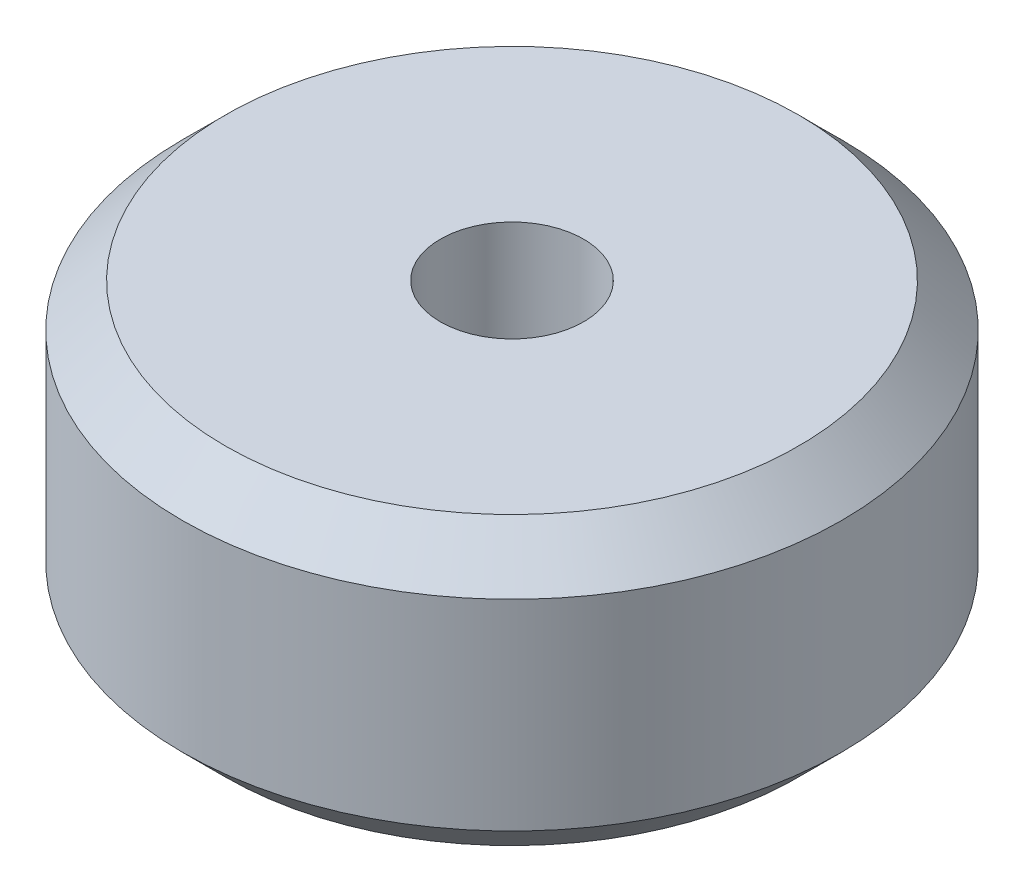
ISO-10303-21;
HEADER;
FILE_DESCRIPTION(('STEP AP214'),'2;1');
FILE_NAME('part.step','',(''),(''),'','','');
FILE_SCHEMA(('AUTOMOTIVE_DESIGN { 1 0 10303 214 1 1 1 1 }'));
ENDSEC;
DATA;
#1=APPLICATION_CONTEXT('core data for automotive mechanical design processes');
#2=APPLICATION_PROTOCOL_DEFINITION('international standard','automotive_design',2000,#1);
#3=PRODUCT_CONTEXT('',#1,'mechanical');
#4=PRODUCT('Part','Part','',(#3));
#5=PRODUCT_RELATED_PRODUCT_CATEGORY('part','',(#4));
#6=PRODUCT_DEFINITION_FORMATION('','',#4);
#7=PRODUCT_DEFINITION_CONTEXT('part definition',#1,'design');
#8=PRODUCT_DEFINITION('design','',#6,#7);
#9=PRODUCT_DEFINITION_SHAPE('','',#8);
#10=(LENGTH_UNIT() NAMED_UNIT(*) SI_UNIT(.MILLI.,.METRE.));
#11=(NAMED_UNIT(*) PLANE_ANGLE_UNIT() SI_UNIT($,.RADIAN.));
#12=(NAMED_UNIT(*) SI_UNIT($,.STERADIAN.) SOLID_ANGLE_UNIT());
#13=UNCERTAINTY_MEASURE_WITH_UNIT(LENGTH_MEASURE(1.E-05),#10,'distance_accuracy_value','');
#14=(GEOMETRIC_REPRESENTATION_CONTEXT(3) GLOBAL_UNCERTAINTY_ASSIGNED_CONTEXT((#13)) GLOBAL_UNIT_ASSIGNED_CONTEXT((#10,
#11,#12)) REPRESENTATION_CONTEXT('',''));
#15=CARTESIAN_POINT('',(0.,0.,0.));
#16=DIRECTION('',(0.,0.,1.));
#17=DIRECTION('',(1.,0.,0.));
#18=AXIS2_PLACEMENT_3D('',#15,#16,#17);
#19=CARTESIAN_POINT('',(0.,50.,0.));
#20=DIRECTION('',(0.,1.,0.));
#21=DIRECTION('',(0.,0.,1.));
#22=AXIS2_PLACEMENT_3D('',#19,#20,#21);
#23=CYLINDRICAL_SURFACE('',#22,2.5);
#24=CARTESIAN_POINT('',(0.,-5.,0.));
#25=DIRECTION('',(0.,1.,0.));
#26=DIRECTION('',(0.,0.,1.));
#27=AXIS2_PLACEMENT_3D('',#24,#25,#26);
#28=CIRCLE('',#27,2.5);
#29=CARTESIAN_POINT('',(0.,-5.,2.5));
#30=VERTEX_POINT('',#29);
#31=EDGE_CURVE('E55',#30,#30,#28,.T.);
#32=ORIENTED_EDGE('',*,*,#31,.F.);
#33=EDGE_LOOP('',(#32));
#34=FACE_BOUND('',#33,.T.);
#35=CARTESIAN_POINT('',(0.,5.,0.));
#36=DIRECTION('',(0.,1.,0.));
#37=DIRECTION('',(0.,0.,1.));
#38=AXIS2_PLACEMENT_3D('',#35,#36,#37);
#39=CIRCLE('',#38,2.5);
#40=CARTESIAN_POINT('',(0.,5.,2.5));
#41=VERTEX_POINT('',#40);
#42=EDGE_CURVE('E10',#41,#41,#39,.T.);
#43=ORIENTED_EDGE('',*,*,#42,.T.);
#44=EDGE_LOOP('',(#43));
#45=FACE_BOUND('',#44,.T.);
#46=ADVANCED_FACE('F33',(#34,#45),#23,.F.);
#47=CARTESIAN_POINT('',(2.5,5.,0.));
#48=DIRECTION('',(0.,-1.,0.));
#49=DIRECTION('',(0.,0.,-1.));
#50=AXIS2_PLACEMENT_3D('',#47,#48,#49);
#51=PLANE('',#50);
#52=ORIENTED_EDGE('',*,*,#42,.F.);
#53=EDGE_LOOP('',(#52));
#54=FACE_BOUND('',#53,.T.);
#55=CARTESIAN_POINT('',(0.,5.,0.));
#56=DIRECTION('',(0.,1.,0.));
#57=DIRECTION('',(0.,0.,1.));
#58=AXIS2_PLACEMENT_3D('',#55,#56,#57);
#59=CIRCLE('',#58,10.);
#60=CARTESIAN_POINT('',(0.,5.,10.));
#61=VERTEX_POINT('',#60);
#62=EDGE_CURVE('E39',#61,#61,#59,.T.);
#63=ORIENTED_EDGE('',*,*,#62,.T.);
#64=EDGE_LOOP('',(#63));
#65=FACE_BOUND('',#64,.T.);
#66=ADVANCED_FACE('F62',(#54,#65),#51,.F.);
#67=CARTESIAN_POINT('',(0.,3.5,0.));
#68=DIRECTION('',(0.,-1.,0.));
#69=DIRECTION('',(0.,0.,-1.));
#70=AXIS2_PLACEMENT_3D('',#67,#68,#69);
#71=CONICAL_SURFACE('',#70,11.5,0.78539816339745);
#72=ORIENTED_EDGE('',*,*,#62,.F.);
#73=EDGE_LOOP('',(#72));
#74=FACE_BOUND('',#73,.T.);
#75=CARTESIAN_POINT('',(0.,3.5,0.));
#76=DIRECTION('',(0.,1.,0.));
#77=DIRECTION('',(0.,0.,1.));
#78=AXIS2_PLACEMENT_3D('',#75,#76,#77);
#79=CIRCLE('',#78,11.5);
#80=CARTESIAN_POINT('',(0.,3.5,11.5));
#81=VERTEX_POINT('',#80);
#82=EDGE_CURVE('E43',#81,#81,#79,.T.);
#83=ORIENTED_EDGE('',*,*,#82,.T.);
#84=EDGE_LOOP('',(#83));
#85=FACE_BOUND('',#84,.T.);
#86=ADVANCED_FACE('F66',(#74,#85),#71,.T.);
#87=CARTESIAN_POINT('',(0.,50.,0.));
#88=DIRECTION('',(0.,1.,0.));
#89=DIRECTION('',(0.,0.,1.));
#90=AXIS2_PLACEMENT_3D('',#87,#88,#89);
#91=CYLINDRICAL_SURFACE('',#90,11.5);
#92=ORIENTED_EDGE('',*,*,#82,.F.);
#93=EDGE_LOOP('',(#92));
#94=FACE_BOUND('',#93,.T.);
#95=CARTESIAN_POINT('',(0.,-3.5,0.));
#96=DIRECTION('',(0.,1.,0.));
#97=DIRECTION('',(0.,0.,1.));
#98=AXIS2_PLACEMENT_3D('',#95,#96,#97);
#99=CIRCLE('',#98,11.5);
#100=CARTESIAN_POINT('',(0.,-3.5,11.5));
#101=VERTEX_POINT('',#100);
#102=EDGE_CURVE('E47',#101,#101,#99,.T.);
#103=ORIENTED_EDGE('',*,*,#102,.T.);
#104=EDGE_LOOP('',(#103));
#105=FACE_BOUND('',#104,.T.);
#106=ADVANCED_FACE('F71',(#94,#105),#91,.T.);
#107=CARTESIAN_POINT('',(0.,-5.,0.));
#108=DIRECTION('',(0.,1.,0.));
#109=DIRECTION('',(0.,0.,1.));
#110=AXIS2_PLACEMENT_3D('',#107,#108,#109);
#111=CONICAL_SURFACE('',#110,10.,0.785398163397448);
#112=ORIENTED_EDGE('',*,*,#102,.F.);
#113=EDGE_LOOP('',(#112));
#114=FACE_BOUND('',#113,.T.);
#115=CARTESIAN_POINT('',(0.,-5.,0.));
#116=DIRECTION('',(0.,1.,0.));
#117=DIRECTION('',(0.,0.,1.));
#118=AXIS2_PLACEMENT_3D('',#115,#116,#117);
#119=CIRCLE('',#118,10.);
#120=CARTESIAN_POINT('',(0.,-5.,10.));
#121=VERTEX_POINT('',#120);
#122=EDGE_CURVE('E52',#121,#121,#119,.T.);
#123=ORIENTED_EDGE('',*,*,#122,.T.);
#124=EDGE_LOOP('',(#123));
#125=FACE_BOUND('',#124,.T.);
#126=ADVANCED_FACE('F77',(#114,#125),#111,.T.);
#127=CARTESIAN_POINT('',(10.,-5.,0.));
#128=DIRECTION('',(0.,1.,0.));
#129=DIRECTION('',(0.,0.,1.));
#130=AXIS2_PLACEMENT_3D('',#127,#128,#129);
#131=PLANE('',#130);
#132=ORIENTED_EDGE('',*,*,#122,.F.);
#133=EDGE_LOOP('',(#132));
#134=FACE_BOUND('',#133,.T.);
#135=ORIENTED_EDGE('',*,*,#31,.T.);
#136=EDGE_LOOP('',(#135));
#137=FACE_BOUND('',#136,.T.);
#138=ADVANCED_FACE('F59',(#134,#137),#131,.F.);
#139=CLOSED_SHELL('',(#46,#66,#86,#106,#126,#138));
#140=MANIFOLD_SOLID_BREP('B2',#139);
#141=ADVANCED_BREP_SHAPE_REPRESENTATION('',(#18,#140),#14);
#142=SHAPE_DEFINITION_REPRESENTATION(#9,#141);
ENDSEC;
END-ISO-10303-21;
